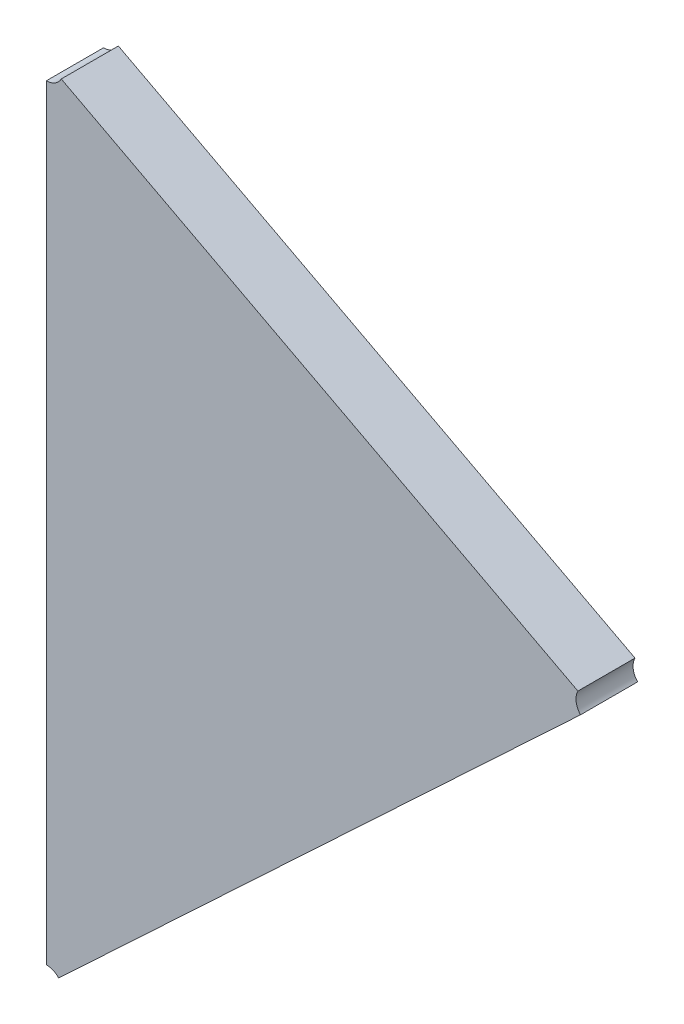
ISO-10303-21;
HEADER;
FILE_DESCRIPTION(('STEP AP214'),'2;1');
FILE_NAME('part.step','',(''),(''),'','','');
FILE_SCHEMA(('AUTOMOTIVE_DESIGN { 1 0 10303 214 1 1 1 1 }'));
ENDSEC;
DATA;
#1=APPLICATION_CONTEXT('core data for automotive mechanical design processes');
#2=APPLICATION_PROTOCOL_DEFINITION('international standard','automotive_design',2000,#1);
#3=PRODUCT_CONTEXT('',#1,'mechanical');
#4=PRODUCT('Part','Part','',(#3));
#5=PRODUCT_RELATED_PRODUCT_CATEGORY('part','',(#4));
#6=PRODUCT_DEFINITION_FORMATION('','',#4);
#7=PRODUCT_DEFINITION_CONTEXT('part definition',#1,'design');
#8=PRODUCT_DEFINITION('design','',#6,#7);
#9=PRODUCT_DEFINITION_SHAPE('','',#8);
#10=(LENGTH_UNIT() NAMED_UNIT(*) SI_UNIT(.MILLI.,.METRE.));
#11=(NAMED_UNIT(*) PLANE_ANGLE_UNIT() SI_UNIT($,.RADIAN.));
#12=(NAMED_UNIT(*) SI_UNIT($,.STERADIAN.) SOLID_ANGLE_UNIT());
#13=UNCERTAINTY_MEASURE_WITH_UNIT(LENGTH_MEASURE(1.E-05),#10,'distance_accuracy_value','');
#14=(GEOMETRIC_REPRESENTATION_CONTEXT(3) GLOBAL_UNCERTAINTY_ASSIGNED_CONTEXT((#13)) GLOBAL_UNIT_ASSIGNED_CONTEXT((#10,
#11,#12)) REPRESENTATION_CONTEXT('',''));
#15=CARTESIAN_POINT('',(0.,0.,0.));
#16=DIRECTION('',(0.,0.,1.));
#17=DIRECTION('',(1.,0.,0.));
#18=AXIS2_PLACEMENT_3D('',#15,#16,#17);
#19=CARTESIAN_POINT('',(-1.69013597604008,-1.2582287551066,0.0042));
#20=DIRECTION('',(0.,0.,1.));
#21=DIRECTION('',(1.,0.,0.));
#22=AXIS2_PLACEMENT_3D('',#19,#20,#21);
#23=PLANE('',#22);
#24=CARTESIAN_POINT('',(-1.71069826462096,-1.30862866219989,0.0042));
#25=DIRECTION('',(0.,0.,-1.));
#26=DIRECTION('',(0.,1.,0.));
#27=AXIS2_PLACEMENT_3D('',#24,#25,#26);
#28=CIRCLE('',#27,0.00199999999999999);
#29=CARTESIAN_POINT('',(-1.71069826462096,-1.30662866219989,0.0042));
#30=VERTEX_POINT('',#29);
#31=CARTESIAN_POINT('',(-1.7092386209274,-1.30726138743312,0.0042));
#32=VERTEX_POINT('',#31);
#33=EDGE_CURVE('E11',#30,#32,#28,.T.);
#34=ORIENTED_EDGE('',*,*,#33,.T.);
#35=DIRECTION('',(0.729821846781321,0.683637383384424,0.));
#36=VECTOR('',#35,1.);
#37=CARTESIAN_POINT('',(-1.7092386209274,-1.30726138743312,0.0042));
#38=LINE('',#37,#36);
#39=CARTESIAN_POINT('',(-1.64708869182362,-1.2490444196931,0.0042));
#40=VERTEX_POINT('',#39);
#41=EDGE_CURVE('E113',#32,#40,#38,.T.);
#42=ORIENTED_EDGE('',*,*,#41,.T.);
#43=CARTESIAN_POINT('',(-1.64562904813006,-1.24767714492633,0.0042));
#44=DIRECTION('',(0.,0.,-1.));
#45=DIRECTION('',(-0.729821846780401,-0.683637383385406,0.));
#46=AXIS2_PLACEMENT_3D('',#43,#44,#45);
#47=CIRCLE('',#46,0.00200000000000002);
#48=CARTESIAN_POINT('',(-1.64739912706553,-1.24674611293859,0.0042));
#49=VERTEX_POINT('',#48);
#50=EDGE_CURVE('E107',#40,#49,#47,.T.);
#51=ORIENTED_EDGE('',*,*,#50,.T.);
#52=DIRECTION('',(-0.885039467737862,0.465515993867324,0.));
#53=VECTOR('',#52,1.);
#54=CARTESIAN_POINT('',(-1.64739912706553,-1.24674611293859,0.0042));
#55=LINE('',#54,#53);
#56=CARTESIAN_POINT('',(-1.70892818568549,-1.21438285466673,0.0042));
#57=VERTEX_POINT('',#56);
#58=EDGE_CURVE('E70',#49,#57,#55,.T.);
#59=ORIENTED_EDGE('',*,*,#58,.T.);
#60=CARTESIAN_POINT('',(-1.71069826462096,-1.213451822679,0.0042));
#61=DIRECTION('',(0.,0.,-1.));
#62=DIRECTION('',(0.885039467738272,-0.465515993866544,0.));
#63=AXIS2_PLACEMENT_3D('',#60,#61,#62);
#64=CIRCLE('',#63,0.00200000000000003);
#65=CARTESIAN_POINT('',(-1.71069826462096,-1.215451822679,0.0042));
#66=VERTEX_POINT('',#65);
#67=EDGE_CURVE('E66',#57,#66,#64,.T.);
#68=ORIENTED_EDGE('',*,*,#67,.T.);
#69=DIRECTION('',(0.,-1.,0.));
#70=VECTOR('',#69,1.);
#71=CARTESIAN_POINT('',(-1.71069826462096,-1.215451822679,0.0042));
#72=LINE('',#71,#70);
#73=EDGE_CURVE('E68',#66,#30,#72,.T.);
#74=ORIENTED_EDGE('',*,*,#73,.T.);
#75=EDGE_LOOP('',(#34,#42,#51,#59,#68,#74));
#76=FACE_BOUND('',#75,.T.);
#77=ADVANCED_FACE('F17',(#76),#23,.T.);
#78=CARTESIAN_POINT('',(-1.69017246726877,-1.25826779665778,-0.0026));
#79=DIRECTION('',(0.,0.,-1.));
#80=DIRECTION('',(-1.,0.,0.));
#81=AXIS2_PLACEMENT_3D('',#78,#79,#80);
#82=PLANE('',#81);
#83=CARTESIAN_POINT('',(-1.71069826462096,-1.30862866219989,-0.0026));
#84=DIRECTION('',(0.,0.,1.));
#85=DIRECTION('',(0.729821846780508,0.683637383385292,0.));
#86=AXIS2_PLACEMENT_3D('',#83,#84,#85);
#87=CIRCLE('',#86,0.00199999999999999);
#88=CARTESIAN_POINT('',(-1.7092386209274,-1.30726138743312,-0.0026));
#89=VERTEX_POINT('',#88);
#90=CARTESIAN_POINT('',(-1.71069826462096,-1.30662866219989,-0.0026));
#91=VERTEX_POINT('',#90);
#92=EDGE_CURVE('E24',#89,#91,#87,.T.);
#93=ORIENTED_EDGE('',*,*,#92,.T.);
#94=DIRECTION('',(0.,1.,0.));
#95=VECTOR('',#94,1.);
#96=CARTESIAN_POINT('',(-1.71069826462096,-1.30662866219989,-0.0026));
#97=LINE('',#96,#95);
#98=CARTESIAN_POINT('',(-1.71069826462096,-1.215451822679,-0.0026));
#99=VERTEX_POINT('',#98);
#100=EDGE_CURVE('E109',#91,#99,#97,.T.);
#101=ORIENTED_EDGE('',*,*,#100,.T.);
#102=CARTESIAN_POINT('',(-1.71069826462096,-1.213451822679,-0.0026));
#103=DIRECTION('',(0.,0.,1.));
#104=DIRECTION('',(0.,-1.,0.));
#105=AXIS2_PLACEMENT_3D('',#102,#103,#104);
#106=CIRCLE('',#105,0.00200000000000003);
#107=CARTESIAN_POINT('',(-1.70892818568549,-1.21438285466673,-0.0026));
#108=VERTEX_POINT('',#107);
#109=EDGE_CURVE('E88',#99,#108,#106,.T.);
#110=ORIENTED_EDGE('',*,*,#109,.T.);
#111=DIRECTION('',(0.885039467737863,-0.465515993867322,0.));
#112=VECTOR('',#111,1.);
#113=CARTESIAN_POINT('',(-1.70892818568549,-1.21438285466673,-0.0026));
#114=LINE('',#113,#112);
#115=CARTESIAN_POINT('',(-1.64739912706553,-1.24674611293859,-0.0026));
#116=VERTEX_POINT('',#115);
#117=EDGE_CURVE('E102',#108,#116,#114,.T.);
#118=ORIENTED_EDGE('',*,*,#117,.T.);
#119=CARTESIAN_POINT('',(-1.64562904813006,-1.24767714492633,-0.0026));
#120=DIRECTION('',(0.,0.,1.));
#121=DIRECTION('',(-0.885039467736168,0.465515993870544,0.));
#122=AXIS2_PLACEMENT_3D('',#119,#120,#121);
#123=CIRCLE('',#122,0.00200000000000002);
#124=CARTESIAN_POINT('',(-1.64708869182362,-1.2490444196931,-0.0026));
#125=VERTEX_POINT('',#124);
#126=EDGE_CURVE('E89',#116,#125,#123,.T.);
#127=ORIENTED_EDGE('',*,*,#126,.T.);
#128=DIRECTION('',(-0.729821846781319,-0.683637383384426,0.));
#129=VECTOR('',#128,1.);
#130=CARTESIAN_POINT('',(-1.64708869182362,-1.2490444196931,-0.0026));
#131=LINE('',#130,#129);
#132=EDGE_CURVE('E97',#125,#89,#131,.T.);
#133=ORIENTED_EDGE('',*,*,#132,.T.);
#134=EDGE_LOOP('',(#93,#101,#110,#118,#127,#133));
#135=FACE_BOUND('',#134,.T.);
#136=ADVANCED_FACE('F125',(#135),#82,.T.);
#137=CARTESIAN_POINT('',(-1.71069826462096,-1.213451822679,-0.0026));
#138=DIRECTION('',(-0.465515993867324,-0.885039467737862,0.));
#139=DIRECTION('',(0.885039467737862,-0.465515993867324,0.));
#140=AXIS2_PLACEMENT_3D('',#137,#138,#139);
#141=PLANE('',#140);
#142=DIRECTION('',(0.,0.,-1.));
#143=VECTOR('',#142,1.);
#144=CARTESIAN_POINT('',(-1.64739912706553,-1.24674611293859,0.0042));
#145=LINE('',#144,#143);
#146=EDGE_CURVE('E111',#49,#116,#145,.T.);
#147=ORIENTED_EDGE('',*,*,#146,.T.);
#148=ORIENTED_EDGE('',*,*,#117,.F.);
#149=DIRECTION('',(0.,0.,1.));
#150=VECTOR('',#149,1.);
#151=CARTESIAN_POINT('',(-1.70892818568549,-1.21438285466673,-0.0026));
#152=LINE('',#151,#150);
#153=EDGE_CURVE('E75',#108,#57,#152,.T.);
#154=ORIENTED_EDGE('',*,*,#153,.T.);
#155=ORIENTED_EDGE('',*,*,#58,.F.);
#156=EDGE_LOOP('',(#147,#148,#154,#155));
#157=FACE_BOUND('',#156,.T.);
#158=ADVANCED_FACE('F124',(#157),#141,.F.);
#159=CARTESIAN_POINT('',(-1.64562904813006,-1.24767714492633,-0.0026));
#160=DIRECTION('',(-0.683637383384425,0.729821846781321,0.));
#161=DIRECTION('',(-0.729821846781321,-0.683637383384425,0.));
#162=AXIS2_PLACEMENT_3D('',#159,#160,#161);
#163=PLANE('',#162);
#164=DIRECTION('',(0.,0.,-1.));
#165=VECTOR('',#164,1.);
#166=CARTESIAN_POINT('',(-1.7092386209274,-1.30726138743312,0.0042));
#167=LINE('',#166,#165);
#168=EDGE_CURVE('E105',#32,#89,#167,.T.);
#169=ORIENTED_EDGE('',*,*,#168,.T.);
#170=ORIENTED_EDGE('',*,*,#132,.F.);
#171=DIRECTION('',(0.,0.,1.));
#172=VECTOR('',#171,1.);
#173=CARTESIAN_POINT('',(-1.64708869182362,-1.2490444196931,-0.0026));
#174=LINE('',#173,#172);
#175=EDGE_CURVE('E83',#125,#40,#174,.T.);
#176=ORIENTED_EDGE('',*,*,#175,.T.);
#177=ORIENTED_EDGE('',*,*,#41,.F.);
#178=EDGE_LOOP('',(#169,#170,#176,#177));
#179=FACE_BOUND('',#178,.T.);
#180=ADVANCED_FACE('F118',(#179),#163,.F.);
#181=CARTESIAN_POINT('',(-1.71069826462096,-1.30862866219989,-0.0026));
#182=DIRECTION('',(1.,0.,0.));
#183=DIRECTION('',(0.,1.,0.));
#184=AXIS2_PLACEMENT_3D('',#181,#182,#183);
#185=PLANE('',#184);
#186=DIRECTION('',(0.,0.,1.));
#187=VECTOR('',#186,1.);
#188=CARTESIAN_POINT('',(-1.71069826462096,-1.30662866219989,-0.0026));
#189=LINE('',#188,#187);
#190=EDGE_CURVE('E82',#91,#30,#189,.T.);
#191=ORIENTED_EDGE('',*,*,#190,.T.);
#192=ORIENTED_EDGE('',*,*,#73,.F.);
#193=DIRECTION('',(0.,0.,1.));
#194=VECTOR('',#193,1.);
#195=CARTESIAN_POINT('',(-1.71069826462096,-1.215451822679,-0.0026));
#196=LINE('',#195,#194);
#197=EDGE_CURVE('E80',#99,#66,#196,.T.);
#198=ORIENTED_EDGE('',*,*,#197,.F.);
#199=ORIENTED_EDGE('',*,*,#100,.F.);
#200=EDGE_LOOP('',(#191,#192,#198,#199));
#201=FACE_BOUND('',#200,.T.);
#202=ADVANCED_FACE('F79',(#201),#185,.F.);
#203=CARTESIAN_POINT('',(-1.71069826462096,-1.213451822679,-0.0018));
#204=DIRECTION('',(0.,0.,1.));
#205=DIRECTION('',(-1.,0.,0.));
#206=AXIS2_PLACEMENT_3D('',#203,#204,#205);
#207=CYLINDRICAL_SURFACE('',#206,0.00200000000000003);
#208=ORIENTED_EDGE('',*,*,#153,.F.);
#209=ORIENTED_EDGE('',*,*,#109,.F.);
#210=ORIENTED_EDGE('',*,*,#197,.T.);
#211=ORIENTED_EDGE('',*,*,#67,.F.);
#212=EDGE_LOOP('',(#208,#209,#210,#211));
#213=FACE_BOUND('',#212,.T.);
#214=ADVANCED_FACE('F86',(#213),#207,.F.);
#215=CARTESIAN_POINT('',(-1.64562904813006,-1.24767714492633,-0.0018));
#216=DIRECTION('',(0.,0.,1.));
#217=DIRECTION('',(-1.,0.,0.));
#218=AXIS2_PLACEMENT_3D('',#215,#216,#217);
#219=CYLINDRICAL_SURFACE('',#218,0.00200000000000002);
#220=ORIENTED_EDGE('',*,*,#146,.F.);
#221=ORIENTED_EDGE('',*,*,#50,.F.);
#222=ORIENTED_EDGE('',*,*,#175,.F.);
#223=ORIENTED_EDGE('',*,*,#126,.F.);
#224=EDGE_LOOP('',(#220,#221,#222,#223));
#225=FACE_BOUND('',#224,.T.);
#226=ADVANCED_FACE('F122',(#225),#219,.F.);
#227=CARTESIAN_POINT('',(-1.71069826462096,-1.30862866219989,-0.0018));
#228=DIRECTION('',(0.,0.,1.));
#229=DIRECTION('',(-1.,0.,0.));
#230=AXIS2_PLACEMENT_3D('',#227,#228,#229);
#231=CYLINDRICAL_SURFACE('',#230,0.00199999999999999);
#232=ORIENTED_EDGE('',*,*,#168,.F.);
#233=ORIENTED_EDGE('',*,*,#33,.F.);
#234=ORIENTED_EDGE('',*,*,#190,.F.);
#235=ORIENTED_EDGE('',*,*,#92,.F.);
#236=EDGE_LOOP('',(#232,#233,#234,#235));
#237=FACE_BOUND('',#236,.T.);
#238=ADVANCED_FACE('F127',(#237),#231,.F.);
#239=CLOSED_SHELL('',(#77,#136,#158,#180,#202,#214,#226,#238));
#240=MANIFOLD_SOLID_BREP('B1',#239);
#241=ADVANCED_BREP_SHAPE_REPRESENTATION('',(#18,#240),#14);
#242=SHAPE_DEFINITION_REPRESENTATION(#9,#241);
ENDSEC;
END-ISO-10303-21;
